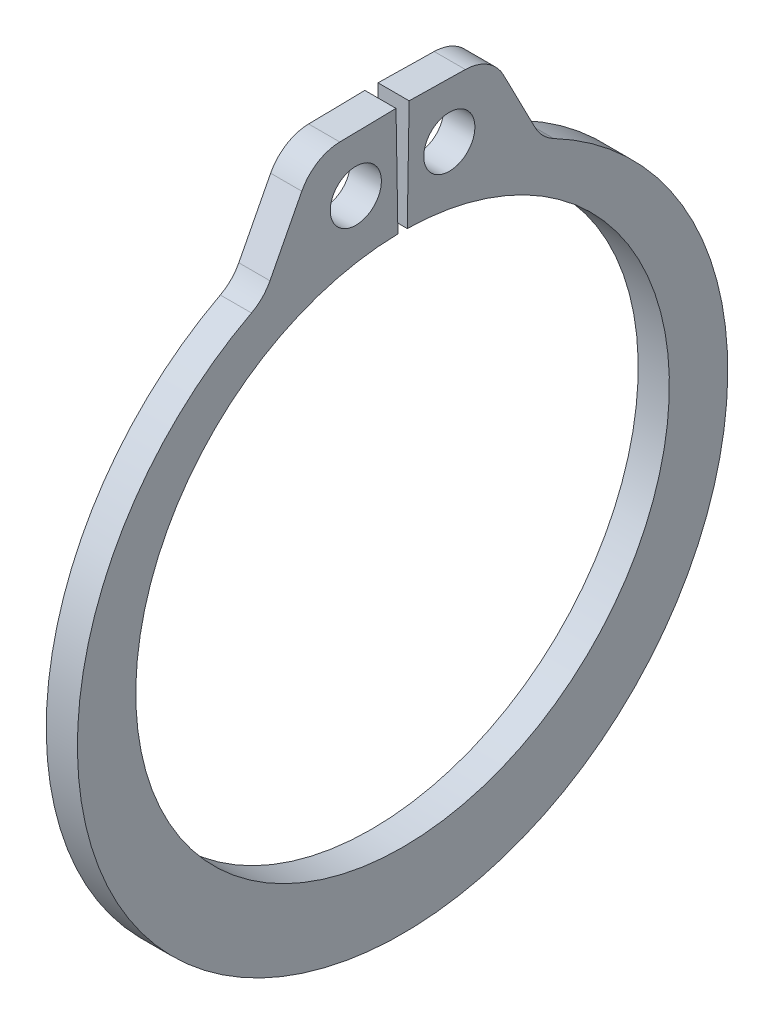
ISO-10303-21;
HEADER;
FILE_DESCRIPTION(('STEP AP214'),'2;1');
FILE_NAME('part.step','',(''),(''),'','','');
FILE_SCHEMA(('AUTOMOTIVE_DESIGN { 1 0 10303 214 1 1 1 1 }'));
ENDSEC;
DATA;
#1=APPLICATION_CONTEXT('core data for automotive mechanical design processes');
#2=APPLICATION_PROTOCOL_DEFINITION('international standard','automotive_design',2000,#1);
#3=PRODUCT_CONTEXT('',#1,'mechanical');
#4=PRODUCT('Part','Part','',(#3));
#5=PRODUCT_RELATED_PRODUCT_CATEGORY('part','',(#4));
#6=PRODUCT_DEFINITION_FORMATION('','',#4);
#7=PRODUCT_DEFINITION_CONTEXT('part definition',#1,'design');
#8=PRODUCT_DEFINITION('design','',#6,#7);
#9=PRODUCT_DEFINITION_SHAPE('','',#8);
#10=(LENGTH_UNIT() NAMED_UNIT(*) SI_UNIT(.MILLI.,.METRE.));
#11=(NAMED_UNIT(*) PLANE_ANGLE_UNIT() SI_UNIT($,.RADIAN.));
#12=(NAMED_UNIT(*) SI_UNIT($,.STERADIAN.) SOLID_ANGLE_UNIT());
#13=UNCERTAINTY_MEASURE_WITH_UNIT(LENGTH_MEASURE(1.E-05),#10,'distance_accuracy_value','');
#14=(GEOMETRIC_REPRESENTATION_CONTEXT(3) GLOBAL_UNCERTAINTY_ASSIGNED_CONTEXT((#13)) GLOBAL_UNIT_ASSIGNED_CONTEXT((#10,
#11,#12)) REPRESENTATION_CONTEXT('',''));
#15=CARTESIAN_POINT('',(0.,0.,0.));
#16=DIRECTION('',(0.,0.,1.));
#17=DIRECTION('',(1.,0.,0.));
#18=AXIS2_PLACEMENT_3D('',#15,#16,#17);
#19=CARTESIAN_POINT('',(0.3175,0.,0.));
#20=DIRECTION('',(1.,0.,0.));
#21=DIRECTION('',(0.,0.,-1.));
#22=AXIS2_PLACEMENT_3D('',#19,#20,#21);
#23=PLANE('',#22);
#24=CARTESIAN_POINT('',(0.3175,6.53757330882311,0.952441447944874));
#25=DIRECTION('',(1.,0.,0.));
#26=DIRECTION('',(0.,0.,-1.));
#27=AXIS2_PLACEMENT_3D('',#24,#25,#26);
#28=CIRCLE('',#27,0.5207);
#29=CARTESIAN_POINT('',(0.3175,6.53757330882311,0.431741447944874));
#30=VERTEX_POINT('',#29);
#31=EDGE_CURVE('E221',#30,#30,#28,.T.);
#32=ORIENTED_EDGE('',*,*,#31,.F.);
#33=EDGE_LOOP('',(#32));
#34=FACE_BOUND('',#33,.T.);
#35=DIRECTION('',(0.,-0.0174524064372771,0.999847695156391));
#36=VECTOR('',#35,1.);
#37=CARTESIAN_POINT('',(0.3175,7.66963170000565,0.133873919299115));
#38=LINE('',#37,#36);
#39=CARTESIAN_POINT('',(0.3175,7.66963170000565,0.133873919299115));
#40=VERTEX_POINT('',#39);
#41=CARTESIAN_POINT('',(0.3175,7.64964498771418,1.27891189960262));
#42=VERTEX_POINT('',#41);
#43=EDGE_CURVE('E133',#40,#42,#38,.T.);
#44=ORIENTED_EDGE('',*,*,#43,.T.);
#45=CARTESIAN_POINT('',(0.3175,6.76078038672015,1.26339671027988));
#46=DIRECTION('',(1.,0.,0.));
#47=DIRECTION('',(0.,0.,-1.));
#48=AXIS2_PLACEMENT_3D('',#45,#46,#47);
#49=CIRCLE('',#48,0.889);
#50=CARTESIAN_POINT('',(0.3175,7.16827724391612,2.05350259645933));
#51=VERTEX_POINT('',#50);
#52=EDGE_CURVE('E174',#42,#51,#49,.T.);
#53=ORIENTED_EDGE('',*,*,#52,.T.);
#54=DIRECTION('',(0.,-0.888758027198479,0.458376667262055));
#55=VECTOR('',#54,1.);
#56=CARTESIAN_POINT('',(0.3175,7.6403744858542,1.81001859545929));
#57=LINE('',#56,#55);
#58=CARTESIAN_POINT('',(0.3175,5.91184475207108,2.70150725085));
#59=VERTEX_POINT('',#58);
#60=EDGE_CURVE('E213',#51,#59,#57,.T.);
#61=ORIENTED_EDGE('',*,*,#60,.T.);
#62=CARTESIAN_POINT('',(0.3175,6.31934160926705,3.49161313702945));
#63=DIRECTION('',(1.,0.,0.));
#64=DIRECTION('',(0.,0.,-1.));
#65=AXIS2_PLACEMENT_3D('',#62,#63,#64);
#66=CIRCLE('',#65,0.889);
#67=CARTESIAN_POINT('',(0.3175,5.5321453172725,3.07852356094451));
#68=VERTEX_POINT('',#67);
#69=EDGE_CURVE('E181',#59,#68,#66,.F.);
#70=ORIENTED_EDGE('',*,*,#69,.T.);
#71=CARTESIAN_POINT('',(0.3175,-0.334384540394782,0.));
#72=DIRECTION('',(1.,0.,0.));
#73=DIRECTION('',(0.,0.,-1.));
#74=AXIS2_PLACEMENT_3D('',#71,#72,#73);
#75=CIRCLE('',#74,6.62521545960523);
#76=CARTESIAN_POINT('',(0.3175,5.5321453172725,-3.07852356094451));
#77=VERTEX_POINT('',#76);
#78=EDGE_CURVE('E206',#68,#77,#75,.T.);
#79=ORIENTED_EDGE('',*,*,#78,.T.);
#80=CARTESIAN_POINT('',(0.3175,6.31934160926705,-3.49161313702945));
#81=DIRECTION('',(1.,0.,0.));
#82=DIRECTION('',(0.,0.,-1.));
#83=AXIS2_PLACEMENT_3D('',#80,#81,#82);
#84=CIRCLE('',#83,0.889);
#85=CARTESIAN_POINT('',(0.3175,5.91184475207108,-2.70150725085));
#86=VERTEX_POINT('',#85);
#87=EDGE_CURVE('E11',#77,#86,#84,.F.);
#88=ORIENTED_EDGE('',*,*,#87,.T.);
#89=DIRECTION('',(0.,0.888758027198479,0.458376667262055));
#90=VECTOR('',#89,1.);
#91=CARTESIAN_POINT('',(0.3175,7.6403744858542,-1.81001859545929));
#92=LINE('',#91,#90);
#93=CARTESIAN_POINT('',(0.3175,7.16827724391612,-2.05350259645933));
#94=VERTEX_POINT('',#93);
#95=EDGE_CURVE('E205',#86,#94,#92,.T.);
#96=ORIENTED_EDGE('',*,*,#95,.T.);
#97=CARTESIAN_POINT('',(0.3175,6.76078038672015,-1.26339671027988));
#98=DIRECTION('',(1.,0.,0.));
#99=DIRECTION('',(0.,0.,-1.));
#100=AXIS2_PLACEMENT_3D('',#97,#98,#99);
#101=CIRCLE('',#100,0.889);
#102=CARTESIAN_POINT('',(0.3175,7.64964498771418,-1.27891189960262));
#103=VERTEX_POINT('',#102);
#104=EDGE_CURVE('E49',#94,#103,#101,.T.);
#105=ORIENTED_EDGE('',*,*,#104,.T.);
#106=DIRECTION('',(0.,0.0174524064372771,0.999847695156391));
#107=VECTOR('',#106,1.);
#108=CARTESIAN_POINT('',(0.3175,7.66963170000565,-0.133873919299115));
#109=LINE('',#108,#107);
#110=CARTESIAN_POINT('',(0.3175,7.66963170000565,-0.133873919299115));
#111=VERTEX_POINT('',#110);
#112=EDGE_CURVE('E210',#103,#111,#109,.T.);
#113=ORIENTED_EDGE('',*,*,#112,.T.);
#114=DIRECTION('',(0.,-0.999847695156391,0.0174524064372833));
#115=VECTOR('',#114,1.);
#116=CARTESIAN_POINT('',(0.3175,5.43477213179208,-0.0948643004304991));
#117=LINE('',#116,#115);
#118=CARTESIAN_POINT('',(0.3175,5.43477213179208,-0.0948643004304991));
#119=VERTEX_POINT('',#118);
#120=EDGE_CURVE('E139',#111,#119,#117,.T.);
#121=ORIENTED_EDGE('',*,*,#120,.T.);
#122=CARTESIAN_POINT('',(0.3175,0.,0.));
#123=DIRECTION('',(-1.,0.,0.));
#124=DIRECTION('',(0.,0.,-1.));
#125=AXIS2_PLACEMENT_3D('',#122,#123,#124);
#126=CIRCLE('',#125,5.4356);
#127=CARTESIAN_POINT('',(0.3175,5.43477213179208,0.0948643004304991));
#128=VERTEX_POINT('',#127);
#129=EDGE_CURVE('E134',#119,#128,#126,.T.);
#130=ORIENTED_EDGE('',*,*,#129,.T.);
#131=DIRECTION('',(0.,0.999847695156391,0.0174524064372833));
#132=VECTOR('',#131,1.);
#133=CARTESIAN_POINT('',(0.3175,5.43477213179208,0.0948643004304991));
#134=LINE('',#133,#132);
#135=EDGE_CURVE('E125',#128,#40,#134,.T.);
#136=ORIENTED_EDGE('',*,*,#135,.T.);
#137=EDGE_LOOP('',(#44,#53,#61,#70,#79,#88,#96,#105,#113,#121,#130,#136));
#138=FACE_BOUND('',#137,.T.);
#139=CARTESIAN_POINT('',(0.3175,6.53757330882311,-0.952441447944874));
#140=DIRECTION('',(1.,0.,0.));
#141=DIRECTION('',(0.,0.,-1.));
#142=AXIS2_PLACEMENT_3D('',#139,#140,#141);
#143=CIRCLE('',#142,0.5207);
#144=CARTESIAN_POINT('',(0.3175,6.53757330882311,-1.47314144794487));
#145=VERTEX_POINT('',#144);
#146=EDGE_CURVE('E247',#145,#145,#143,.T.);
#147=ORIENTED_EDGE('',*,*,#146,.F.);
#148=EDGE_LOOP('',(#147));
#149=FACE_BOUND('',#148,.T.);
#150=ADVANCED_FACE('F34',(#34,#138,#149),#23,.T.);
#151=CARTESIAN_POINT('',(-0.3175,0.,0.));
#152=DIRECTION('',(1.,0.,0.));
#153=DIRECTION('',(0.,0.,-1.));
#154=AXIS2_PLACEMENT_3D('',#151,#152,#153);
#155=PLANE('',#154);
#156=CARTESIAN_POINT('',(-0.3175,6.53757330882311,0.952441447944874));
#157=DIRECTION('',(1.,0.,0.));
#158=DIRECTION('',(0.,0.,-1.));
#159=AXIS2_PLACEMENT_3D('',#156,#157,#158);
#160=CIRCLE('',#159,0.5207);
#161=CARTESIAN_POINT('',(-0.3175,6.53757330882311,0.431741447944874));
#162=VERTEX_POINT('',#161);
#163=EDGE_CURVE('E244',#162,#162,#160,.T.);
#164=ORIENTED_EDGE('',*,*,#163,.T.);
#165=EDGE_LOOP('',(#164));
#166=FACE_BOUND('',#165,.T.);
#167=DIRECTION('',(0.,-0.888758027198479,0.458376667262055));
#168=VECTOR('',#167,1.);
#169=CARTESIAN_POINT('',(-0.3175,7.6403744858542,1.81001859545929));
#170=LINE('',#169,#168);
#171=CARTESIAN_POINT('',(-0.3175,7.16827724391612,2.05350259645933));
#172=VERTEX_POINT('',#171);
#173=CARTESIAN_POINT('',(-0.3175,5.91184475207108,2.70150725085));
#174=VERTEX_POINT('',#173);
#175=EDGE_CURVE('E200',#172,#174,#170,.T.);
#176=ORIENTED_EDGE('',*,*,#175,.F.);
#177=CARTESIAN_POINT('',(-0.3175,6.76078038672015,1.26339671027988));
#178=DIRECTION('',(1.,0.,0.));
#179=DIRECTION('',(0.,0.,-1.));
#180=AXIS2_PLACEMENT_3D('',#177,#178,#179);
#181=CIRCLE('',#180,0.889);
#182=CARTESIAN_POINT('',(-0.3175,7.64964498771418,1.27891189960262));
#183=VERTEX_POINT('',#182);
#184=EDGE_CURVE('E170',#172,#183,#181,.F.);
#185=ORIENTED_EDGE('',*,*,#184,.T.);
#186=DIRECTION('',(0.,-0.0174524064372771,0.999847695156391));
#187=VECTOR('',#186,1.);
#188=CARTESIAN_POINT('',(-0.3175,7.66963170000565,0.133873919299115));
#189=LINE('',#188,#187);
#190=CARTESIAN_POINT('',(-0.3175,7.66963170000565,0.133873919299115));
#191=VERTEX_POINT('',#190);
#192=EDGE_CURVE('E223',#191,#183,#189,.T.);
#193=ORIENTED_EDGE('',*,*,#192,.F.);
#194=DIRECTION('',(0.,0.999847695156391,0.0174524064372833));
#195=VECTOR('',#194,1.);
#196=CARTESIAN_POINT('',(-0.3175,5.43477213179208,0.0948643004304991));
#197=LINE('',#196,#195);
#198=CARTESIAN_POINT('',(-0.3175,5.43477213179208,0.0948643004304991));
#199=VERTEX_POINT('',#198);
#200=EDGE_CURVE('E220',#199,#191,#197,.T.);
#201=ORIENTED_EDGE('',*,*,#200,.F.);
#202=CARTESIAN_POINT('',(-0.3175,0.,0.));
#203=DIRECTION('',(-1.,0.,0.));
#204=DIRECTION('',(0.,0.,-1.));
#205=AXIS2_PLACEMENT_3D('',#202,#203,#204);
#206=CIRCLE('',#205,5.4356);
#207=CARTESIAN_POINT('',(-0.3175,5.43477213179208,-0.0948643004304991));
#208=VERTEX_POINT('',#207);
#209=EDGE_CURVE('E147',#208,#199,#206,.T.);
#210=ORIENTED_EDGE('',*,*,#209,.F.);
#211=DIRECTION('',(0.,-0.999847695156391,0.0174524064372833));
#212=VECTOR('',#211,1.);
#213=CARTESIAN_POINT('',(-0.3175,5.43477213179208,-0.0948643004304991));
#214=LINE('',#213,#212);
#215=CARTESIAN_POINT('',(-0.3175,7.66963170000565,-0.133873919299115));
#216=VERTEX_POINT('',#215);
#217=EDGE_CURVE('E143',#216,#208,#214,.T.);
#218=ORIENTED_EDGE('',*,*,#217,.F.);
#219=DIRECTION('',(0.,0.0174524064372771,0.999847695156391));
#220=VECTOR('',#219,1.);
#221=CARTESIAN_POINT('',(-0.3175,7.66963170000565,-0.133873919299115));
#222=LINE('',#221,#220);
#223=CARTESIAN_POINT('',(-0.3175,7.64964498771418,-1.27891189960262));
#224=VERTEX_POINT('',#223);
#225=EDGE_CURVE('E228',#224,#216,#222,.T.);
#226=ORIENTED_EDGE('',*,*,#225,.F.);
#227=CARTESIAN_POINT('',(-0.3175,6.76078038672015,-1.26339671027988));
#228=DIRECTION('',(1.,0.,0.));
#229=DIRECTION('',(0.,0.,-1.));
#230=AXIS2_PLACEMENT_3D('',#227,#228,#229);
#231=CIRCLE('',#230,0.889);
#232=CARTESIAN_POINT('',(-0.3175,7.16827724391612,-2.05350259645933));
#233=VERTEX_POINT('',#232);
#234=EDGE_CURVE('E168',#224,#233,#231,.F.);
#235=ORIENTED_EDGE('',*,*,#234,.T.);
#236=DIRECTION('',(0.,0.888758027198479,0.458376667262055));
#237=VECTOR('',#236,1.);
#238=CARTESIAN_POINT('',(-0.3175,7.6403744858542,-1.81001859545929));
#239=LINE('',#238,#237);
#240=CARTESIAN_POINT('',(-0.3175,5.91184475207108,-2.70150725085));
#241=VERTEX_POINT('',#240);
#242=EDGE_CURVE('E191',#241,#233,#239,.T.);
#243=ORIENTED_EDGE('',*,*,#242,.F.);
#244=CARTESIAN_POINT('',(-0.3175,6.31934160926705,-3.49161313702945));
#245=DIRECTION('',(1.,0.,0.));
#246=DIRECTION('',(0.,0.,-1.));
#247=AXIS2_PLACEMENT_3D('',#244,#245,#246);
#248=CIRCLE('',#247,0.889);
#249=CARTESIAN_POINT('',(-0.3175,5.5321453172725,-3.07852356094451));
#250=VERTEX_POINT('',#249);
#251=EDGE_CURVE('E42',#241,#250,#248,.T.);
#252=ORIENTED_EDGE('',*,*,#251,.T.);
#253=CARTESIAN_POINT('',(-0.3175,-0.334384540394782,0.));
#254=DIRECTION('',(1.,0.,0.));
#255=DIRECTION('',(0.,0.,-1.));
#256=AXIS2_PLACEMENT_3D('',#253,#254,#255);
#257=CIRCLE('',#256,6.62521545960523);
#258=CARTESIAN_POINT('',(-0.3175,5.5321453172725,3.07852356094451));
#259=VERTEX_POINT('',#258);
#260=EDGE_CURVE('E189',#259,#250,#257,.T.);
#261=ORIENTED_EDGE('',*,*,#260,.F.);
#262=CARTESIAN_POINT('',(-0.3175,6.31934160926705,3.49161313702945));
#263=DIRECTION('',(1.,0.,0.));
#264=DIRECTION('',(0.,0.,-1.));
#265=AXIS2_PLACEMENT_3D('',#262,#263,#264);
#266=CIRCLE('',#265,0.889);
#267=EDGE_CURVE('E179',#259,#174,#266,.T.);
#268=ORIENTED_EDGE('',*,*,#267,.T.);
#269=EDGE_LOOP('',(#176,#185,#193,#201,#210,#218,#226,#235,#243,#252,#261,#268));
#270=FACE_BOUND('',#269,.T.);
#271=CARTESIAN_POINT('',(-0.3175,6.53757330882311,-0.952441447944874));
#272=DIRECTION('',(1.,0.,0.));
#273=DIRECTION('',(0.,0.,-1.));
#274=AXIS2_PLACEMENT_3D('',#271,#272,#273);
#275=CIRCLE('',#274,0.5207);
#276=CARTESIAN_POINT('',(-0.3175,6.53757330882311,-1.47314144794487));
#277=VERTEX_POINT('',#276);
#278=EDGE_CURVE('E250',#277,#277,#275,.T.);
#279=ORIENTED_EDGE('',*,*,#278,.T.);
#280=EDGE_LOOP('',(#279));
#281=FACE_BOUND('',#280,.T.);
#282=ADVANCED_FACE('F187',(#166,#270,#281),#155,.F.);
#283=CARTESIAN_POINT('',(0.3175,0.,0.));
#284=DIRECTION('',(-1.,0.,0.));
#285=DIRECTION('',(0.,0.,1.));
#286=AXIS2_PLACEMENT_3D('',#283,#284,#285);
#287=CYLINDRICAL_SURFACE('',#286,5.4356);
#288=ORIENTED_EDGE('',*,*,#209,.T.);
#289=DIRECTION('',(-1.,0.,0.));
#290=VECTOR('',#289,1.);
#291=CARTESIAN_POINT('',(0.3175,5.43477213179208,0.0948643004304991));
#292=LINE('',#291,#290);
#293=EDGE_CURVE('E129',#128,#199,#292,.T.);
#294=ORIENTED_EDGE('',*,*,#293,.F.);
#295=ORIENTED_EDGE('',*,*,#129,.F.);
#296=DIRECTION('',(-1.,0.,0.));
#297=VECTOR('',#296,1.);
#298=CARTESIAN_POINT('',(0.3175,5.43477213179208,-0.0948643004304991));
#299=LINE('',#298,#297);
#300=EDGE_CURVE('E218',#119,#208,#299,.T.);
#301=ORIENTED_EDGE('',*,*,#300,.T.);
#302=EDGE_LOOP('',(#288,#294,#295,#301));
#303=FACE_BOUND('',#302,.T.);
#304=ADVANCED_FACE('F145',(#303),#287,.F.);
#305=CARTESIAN_POINT('',(0.3175,5.43477213179208,0.0948643004304991));
#306=DIRECTION('',(0.,-0.0174524064372833,0.999847695156391));
#307=DIRECTION('',(0.,-0.999847695156391,-0.0174524064372833));
#308=AXIS2_PLACEMENT_3D('',#305,#306,#307);
#309=PLANE('',#308);
#310=ORIENTED_EDGE('',*,*,#200,.T.);
#311=DIRECTION('',(-1.,0.,0.));
#312=VECTOR('',#311,1.);
#313=CARTESIAN_POINT('',(0.3175,7.66963170000565,0.133873919299115));
#314=LINE('',#313,#312);
#315=EDGE_CURVE('E132',#40,#191,#314,.T.);
#316=ORIENTED_EDGE('',*,*,#315,.F.);
#317=ORIENTED_EDGE('',*,*,#135,.F.);
#318=ORIENTED_EDGE('',*,*,#293,.T.);
#319=EDGE_LOOP('',(#310,#316,#317,#318));
#320=FACE_BOUND('',#319,.T.);
#321=ADVANCED_FACE('F127',(#320),#309,.F.);
#322=CARTESIAN_POINT('',(0.3175,7.66963170000565,0.133873919299115));
#323=DIRECTION('',(0.,-0.999847695156391,-0.0174524064372771));
#324=DIRECTION('',(0.,0.0174524064372771,-0.999847695156391));
#325=AXIS2_PLACEMENT_3D('',#322,#323,#324);
#326=PLANE('',#325);
#327=ORIENTED_EDGE('',*,*,#192,.T.);
#328=DIRECTION('',(-1.,0.,0.));
#329=VECTOR('',#328,1.);
#330=CARTESIAN_POINT('',(0.3175,7.64964498771418,1.27891189960262));
#331=LINE('',#330,#329);
#332=EDGE_CURVE('E57',#183,#42,#331,.F.);
#333=ORIENTED_EDGE('',*,*,#332,.T.);
#334=ORIENTED_EDGE('',*,*,#43,.F.);
#335=ORIENTED_EDGE('',*,*,#315,.T.);
#336=EDGE_LOOP('',(#327,#333,#334,#335));
#337=FACE_BOUND('',#336,.T.);
#338=ADVANCED_FACE('F239',(#337),#326,.F.);
#339=CARTESIAN_POINT('',(0.3175,7.6403744858542,1.81001859545929));
#340=DIRECTION('',(0.,-0.458376667262055,-0.888758027198479));
#341=DIRECTION('',(0.,0.888758027198479,-0.458376667262055));
#342=AXIS2_PLACEMENT_3D('',#339,#340,#341);
#343=PLANE('',#342);
#344=ORIENTED_EDGE('',*,*,#175,.T.);
#345=DIRECTION('',(1.,0.,0.));
#346=VECTOR('',#345,1.);
#347=CARTESIAN_POINT('',(0.3175,5.91184475207108,2.70150725085));
#348=LINE('',#347,#346);
#349=EDGE_CURVE('E161',#174,#59,#348,.T.);
#350=ORIENTED_EDGE('',*,*,#349,.T.);
#351=ORIENTED_EDGE('',*,*,#60,.F.);
#352=DIRECTION('',(-1.,0.,0.));
#353=VECTOR('',#352,1.);
#354=CARTESIAN_POINT('',(0.3175,7.16827724391612,2.05350259645933));
#355=LINE('',#354,#353);
#356=EDGE_CURVE('E158',#51,#172,#355,.T.);
#357=ORIENTED_EDGE('',*,*,#356,.T.);
#358=EDGE_LOOP('',(#344,#350,#351,#357));
#359=FACE_BOUND('',#358,.T.);
#360=ADVANCED_FACE('F280',(#359),#343,.F.);
#361=CARTESIAN_POINT('',(0.3175,-0.334384540394782,0.));
#362=DIRECTION('',(-1.,0.,0.));
#363=DIRECTION('',(0.,0.,1.));
#364=AXIS2_PLACEMENT_3D('',#361,#362,#363);
#365=CYLINDRICAL_SURFACE('',#364,6.62521545960523);
#366=ORIENTED_EDGE('',*,*,#78,.F.);
#367=DIRECTION('',(-1.,0.,0.));
#368=VECTOR('',#367,1.);
#369=CARTESIAN_POINT('',(0.3175,5.53214531727249,3.07852356094451));
#370=LINE('',#369,#368);
#371=EDGE_CURVE('E150',#68,#259,#370,.T.);
#372=ORIENTED_EDGE('',*,*,#371,.T.);
#373=ORIENTED_EDGE('',*,*,#260,.T.);
#374=DIRECTION('',(-1.,0.,0.));
#375=VECTOR('',#374,1.);
#376=CARTESIAN_POINT('',(0.3175,5.53214531727249,-3.07852356094451));
#377=LINE('',#376,#375);
#378=EDGE_CURVE('E148',#250,#77,#377,.F.);
#379=ORIENTED_EDGE('',*,*,#378,.T.);
#380=EDGE_LOOP('',(#366,#372,#373,#379));
#381=FACE_BOUND('',#380,.T.);
#382=ADVANCED_FACE('F197',(#381),#365,.T.);
#383=CARTESIAN_POINT('',(0.3175,7.6403744858542,-1.81001859545929));
#384=DIRECTION('',(0.,-0.458376667262055,0.888758027198479));
#385=DIRECTION('',(0.,-0.888758027198479,-0.458376667262055));
#386=AXIS2_PLACEMENT_3D('',#383,#384,#385);
#387=PLANE('',#386);
#388=ORIENTED_EDGE('',*,*,#95,.F.);
#389=DIRECTION('',(1.,0.,0.));
#390=VECTOR('',#389,1.);
#391=CARTESIAN_POINT('',(-0.3175,5.91184475207108,-2.70150725085));
#392=LINE('',#391,#390);
#393=EDGE_CURVE('E165',#86,#241,#392,.F.);
#394=ORIENTED_EDGE('',*,*,#393,.T.);
#395=ORIENTED_EDGE('',*,*,#242,.T.);
#396=DIRECTION('',(-1.,0.,0.));
#397=VECTOR('',#396,1.);
#398=CARTESIAN_POINT('',(0.3175,7.16827724391612,-2.05350259645933));
#399=LINE('',#398,#397);
#400=EDGE_CURVE('E163',#233,#94,#399,.F.);
#401=ORIENTED_EDGE('',*,*,#400,.T.);
#402=EDGE_LOOP('',(#388,#394,#395,#401));
#403=FACE_BOUND('',#402,.T.);
#404=ADVANCED_FACE('F208',(#403),#387,.F.);
#405=CARTESIAN_POINT('',(0.3175,7.66963170000565,-0.133873919299115));
#406=DIRECTION('',(0.,-0.999847695156391,0.0174524064372771));
#407=DIRECTION('',(0.,-0.0174524064372771,-0.999847695156391));
#408=AXIS2_PLACEMENT_3D('',#405,#406,#407);
#409=PLANE('',#408);
#410=ORIENTED_EDGE('',*,*,#112,.F.);
#411=DIRECTION('',(-1.,0.,0.));
#412=VECTOR('',#411,1.);
#413=CARTESIAN_POINT('',(0.3175,7.64964498771418,-1.27891189960262));
#414=LINE('',#413,#412);
#415=EDGE_CURVE('E176',#103,#224,#414,.T.);
#416=ORIENTED_EDGE('',*,*,#415,.T.);
#417=ORIENTED_EDGE('',*,*,#225,.T.);
#418=DIRECTION('',(-1.,0.,0.));
#419=VECTOR('',#418,1.);
#420=CARTESIAN_POINT('',(0.3175,7.66963170000565,-0.133873919299115));
#421=LINE('',#420,#419);
#422=EDGE_CURVE('E152',#111,#216,#421,.T.);
#423=ORIENTED_EDGE('',*,*,#422,.F.);
#424=EDGE_LOOP('',(#410,#416,#417,#423));
#425=FACE_BOUND('',#424,.T.);
#426=ADVANCED_FACE('F273',(#425),#409,.F.);
#427=CARTESIAN_POINT('',(0.3175,5.43477213179208,-0.0948643004304991));
#428=DIRECTION('',(0.,-0.0174524064372833,-0.999847695156391));
#429=DIRECTION('',(0.,0.999847695156391,-0.0174524064372833));
#430=AXIS2_PLACEMENT_3D('',#427,#428,#429);
#431=PLANE('',#430);
#432=ORIENTED_EDGE('',*,*,#217,.T.);
#433=ORIENTED_EDGE('',*,*,#300,.F.);
#434=ORIENTED_EDGE('',*,*,#120,.F.);
#435=ORIENTED_EDGE('',*,*,#422,.T.);
#436=EDGE_LOOP('',(#432,#433,#434,#435));
#437=FACE_BOUND('',#436,.T.);
#438=ADVANCED_FACE('F235',(#437),#431,.F.);
#439=CARTESIAN_POINT('',(0.3175,6.53757330882311,0.952441447944874));
#440=DIRECTION('',(-1.,0.,0.));
#441=DIRECTION('',(0.,0.,1.));
#442=AXIS2_PLACEMENT_3D('',#439,#440,#441);
#443=CYLINDRICAL_SURFACE('',#442,0.5207);
#444=ORIENTED_EDGE('',*,*,#31,.T.);
#445=EDGE_LOOP('',(#444));
#446=FACE_BOUND('',#445,.T.);
#447=ORIENTED_EDGE('',*,*,#163,.F.);
#448=EDGE_LOOP('',(#447));
#449=FACE_BOUND('',#448,.T.);
#450=ADVANCED_FACE('F268',(#446,#449),#443,.F.);
#451=CARTESIAN_POINT('',(0.3175,6.53757330882311,-0.952441447944874));
#452=DIRECTION('',(-1.,0.,0.));
#453=DIRECTION('',(0.,0.,1.));
#454=AXIS2_PLACEMENT_3D('',#451,#452,#453);
#455=CYLINDRICAL_SURFACE('',#454,0.5207);
#456=ORIENTED_EDGE('',*,*,#146,.T.);
#457=EDGE_LOOP('',(#456));
#458=FACE_BOUND('',#457,.T.);
#459=ORIENTED_EDGE('',*,*,#278,.F.);
#460=EDGE_LOOP('',(#459));
#461=FACE_BOUND('',#460,.T.);
#462=ADVANCED_FACE('F256',(#458,#461),#455,.F.);
#463=CARTESIAN_POINT('',(0.3175,6.31934160926705,3.49161313702945));
#464=DIRECTION('',(-1.,0.,0.));
#465=DIRECTION('',(0.,0.,1.));
#466=AXIS2_PLACEMENT_3D('',#463,#464,#465);
#467=CYLINDRICAL_SURFACE('',#466,0.889);
#468=ORIENTED_EDGE('',*,*,#69,.F.);
#469=ORIENTED_EDGE('',*,*,#349,.F.);
#470=ORIENTED_EDGE('',*,*,#267,.F.);
#471=ORIENTED_EDGE('',*,*,#371,.F.);
#472=EDGE_LOOP('',(#468,#469,#470,#471));
#473=FACE_BOUND('',#472,.T.);
#474=ADVANCED_FACE('F290',(#473),#467,.F.);
#475=CARTESIAN_POINT('',(0.3175,6.31934160926705,-3.49161313702945));
#476=DIRECTION('',(-1.,0.,0.));
#477=DIRECTION('',(0.,0.,1.));
#478=AXIS2_PLACEMENT_3D('',#475,#476,#477);
#479=CYLINDRICAL_SURFACE('',#478,0.889);
#480=ORIENTED_EDGE('',*,*,#87,.F.);
#481=ORIENTED_EDGE('',*,*,#378,.F.);
#482=ORIENTED_EDGE('',*,*,#251,.F.);
#483=ORIENTED_EDGE('',*,*,#393,.F.);
#484=EDGE_LOOP('',(#480,#481,#482,#483));
#485=FACE_BOUND('',#484,.T.);
#486=ADVANCED_FACE('F203',(#485),#479,.F.);
#487=CARTESIAN_POINT('',(0.3175,6.76078038672015,1.26339671027988));
#488=DIRECTION('',(-1.,0.,0.));
#489=DIRECTION('',(0.,0.,1.));
#490=AXIS2_PLACEMENT_3D('',#487,#488,#489);
#491=CYLINDRICAL_SURFACE('',#490,0.889);
#492=ORIENTED_EDGE('',*,*,#52,.F.);
#493=ORIENTED_EDGE('',*,*,#332,.F.);
#494=ORIENTED_EDGE('',*,*,#184,.F.);
#495=ORIENTED_EDGE('',*,*,#356,.F.);
#496=EDGE_LOOP('',(#492,#493,#494,#495));
#497=FACE_BOUND('',#496,.T.);
#498=ADVANCED_FACE('F295',(#497),#491,.T.);
#499=CARTESIAN_POINT('',(0.3175,6.76078038672015,-1.26339671027988));
#500=DIRECTION('',(-1.,0.,0.));
#501=DIRECTION('',(0.,0.,1.));
#502=AXIS2_PLACEMENT_3D('',#499,#500,#501);
#503=CYLINDRICAL_SURFACE('',#502,0.889);
#504=ORIENTED_EDGE('',*,*,#104,.F.);
#505=ORIENTED_EDGE('',*,*,#400,.F.);
#506=ORIENTED_EDGE('',*,*,#234,.F.);
#507=ORIENTED_EDGE('',*,*,#415,.F.);
#508=EDGE_LOOP('',(#504,#505,#506,#507));
#509=FACE_BOUND('',#508,.T.);
#510=ADVANCED_FACE('F36',(#509),#503,.T.);
#511=CLOSED_SHELL('',(#150,#282,#304,#321,#338,#360,#382,#404,#426,#438,#450,#462,#474,#486,
#498,#510));
#512=MANIFOLD_SOLID_BREP('B2',#511);
#513=ADVANCED_BREP_SHAPE_REPRESENTATION('',(#18,#512),#14);
#514=SHAPE_DEFINITION_REPRESENTATION(#9,#513);
ENDSEC;
END-ISO-10303-21;
